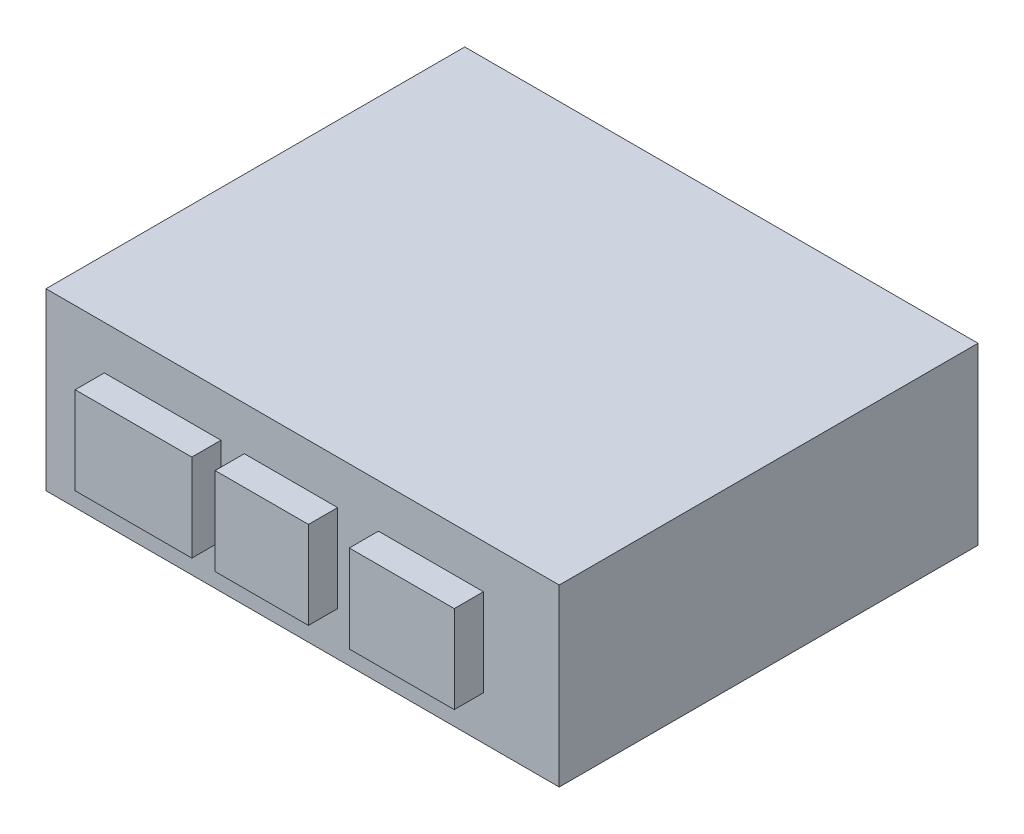
ISO-10303-21;
HEADER;
FILE_DESCRIPTION(('STEP AP214'),'2;1');
FILE_NAME('part.step','',(''),(''),'','','');
FILE_SCHEMA(('AUTOMOTIVE_DESIGN { 1 0 10303 214 1 1 1 1 }'));
ENDSEC;
DATA;
#1=APPLICATION_CONTEXT('core data for automotive mechanical design processes');
#2=APPLICATION_PROTOCOL_DEFINITION('international standard','automotive_design',2000,#1);
#3=PRODUCT_CONTEXT('',#1,'mechanical');
#4=PRODUCT('Part','Part','',(#3));
#5=PRODUCT_RELATED_PRODUCT_CATEGORY('part','',(#4));
#6=PRODUCT_DEFINITION_FORMATION('','',#4);
#7=PRODUCT_DEFINITION_CONTEXT('part definition',#1,'design');
#8=PRODUCT_DEFINITION('design','',#6,#7);
#9=PRODUCT_DEFINITION_SHAPE('','',#8);
#10=(LENGTH_UNIT() NAMED_UNIT(*) SI_UNIT(.MILLI.,.METRE.));
#11=(NAMED_UNIT(*) PLANE_ANGLE_UNIT() SI_UNIT($,.RADIAN.));
#12=(NAMED_UNIT(*) SI_UNIT($,.STERADIAN.) SOLID_ANGLE_UNIT());
#13=UNCERTAINTY_MEASURE_WITH_UNIT(LENGTH_MEASURE(1.E-05),#10,'distance_accuracy_value','');
#14=(GEOMETRIC_REPRESENTATION_CONTEXT(3) GLOBAL_UNCERTAINTY_ASSIGNED_CONTEXT((#13)) GLOBAL_UNIT_ASSIGNED_CONTEXT((#10,
#11,#12)) REPRESENTATION_CONTEXT('',''));
#15=CARTESIAN_POINT('',(0.,0.,0.));
#16=DIRECTION('',(0.,0.,1.));
#17=DIRECTION('',(1.,0.,0.));
#18=AXIS2_PLACEMENT_3D('',#15,#16,#17);
#19=CARTESIAN_POINT('',(-44.,30.,35.9));
#20=DIRECTION('',(0.,0.,-1.));
#21=DIRECTION('',(-1.,0.,0.));
#22=AXIS2_PLACEMENT_3D('',#19,#20,#21);
#23=PLANE('',#22);
#24=DIRECTION('',(0.,1.,0.));
#25=VECTOR('',#24,1.);
#26=CARTESIAN_POINT('',(6.,7.5,35.9));
#27=LINE('',#26,#25);
#28=CARTESIAN_POINT('',(6.,7.5,35.9));
#29=VERTEX_POINT('',#28);
#30=CARTESIAN_POINT('',(6.,22.5,35.9));
#31=VERTEX_POINT('',#30);
#32=EDGE_CURVE('E168',#29,#31,#27,.T.);
#33=ORIENTED_EDGE('',*,*,#32,.F.);
#34=DIRECTION('',(1.,0.,0.));
#35=VECTOR('',#34,1.);
#36=CARTESIAN_POINT('',(-10.,7.5,35.9));
#37=LINE('',#36,#35);
#38=CARTESIAN_POINT('',(-10.,7.5,35.9));
#39=VERTEX_POINT('',#38);
#40=EDGE_CURVE('E181',#39,#29,#37,.T.);
#41=ORIENTED_EDGE('',*,*,#40,.F.);
#42=DIRECTION('',(0.,-1.,0.));
#43=VECTOR('',#42,1.);
#44=CARTESIAN_POINT('',(-10.,7.5,35.9));
#45=LINE('',#44,#43);
#46=CARTESIAN_POINT('',(-10.,22.5,35.9));
#47=VERTEX_POINT('',#46);
#48=EDGE_CURVE('E190',#47,#39,#45,.T.);
#49=ORIENTED_EDGE('',*,*,#48,.F.);
#50=DIRECTION('',(-1.,0.,0.));
#51=VECTOR('',#50,1.);
#52=CARTESIAN_POINT('',(-10.,22.5,35.9));
#53=LINE('',#52,#51);
#54=EDGE_CURVE('E171',#31,#47,#53,.T.);
#55=ORIENTED_EDGE('',*,*,#54,.F.);
#56=EDGE_LOOP('',(#33,#41,#49,#55));
#57=FACE_BOUND('',#56,.T.);
#58=DIRECTION('',(1.,0.,0.));
#59=VECTOR('',#58,1.);
#60=CARTESIAN_POINT('',(-44.,0.,35.9));
#61=LINE('',#60,#59);
#62=CARTESIAN_POINT('',(-44.,0.,35.9));
#63=VERTEX_POINT('',#62);
#64=CARTESIAN_POINT('',(44.,0.,35.9));
#65=VERTEX_POINT('',#64);
#66=EDGE_CURVE('E244',#63,#65,#61,.T.);
#67=ORIENTED_EDGE('',*,*,#66,.T.);
#68=DIRECTION('',(0.,-1.,0.));
#69=VECTOR('',#68,1.);
#70=CARTESIAN_POINT('',(44.,30.,35.9));
#71=LINE('',#70,#69);
#72=CARTESIAN_POINT('',(44.,30.,35.9));
#73=VERTEX_POINT('',#72);
#74=EDGE_CURVE('E250',#73,#65,#71,.T.);
#75=ORIENTED_EDGE('',*,*,#74,.F.);
#76=DIRECTION('',(1.,0.,0.));
#77=VECTOR('',#76,1.);
#78=CARTESIAN_POINT('',(-44.,30.,35.9));
#79=LINE('',#78,#77);
#80=CARTESIAN_POINT('',(-44.,30.,35.9));
#81=VERTEX_POINT('',#80);
#82=EDGE_CURVE('E248',#81,#73,#79,.T.);
#83=ORIENTED_EDGE('',*,*,#82,.F.);
#84=DIRECTION('',(0.,-1.,0.));
#85=VECTOR('',#84,1.);
#86=CARTESIAN_POINT('',(-44.,30.,35.9));
#87=LINE('',#86,#85);
#88=EDGE_CURVE('E260',#81,#63,#87,.T.);
#89=ORIENTED_EDGE('',*,*,#88,.T.);
#90=EDGE_LOOP('',(#67,#75,#83,#89));
#91=FACE_BOUND('',#90,.T.);
#92=DIRECTION('',(0.,1.,0.));
#93=VECTOR('',#92,1.);
#94=CARTESIAN_POINT('',(-14.,7.5,35.9));
#95=LINE('',#94,#93);
#96=CARTESIAN_POINT('',(-14.,7.5,35.9));
#97=VERTEX_POINT('',#96);
#98=CARTESIAN_POINT('',(-14.,22.5,35.9));
#99=VERTEX_POINT('',#98);
#100=EDGE_CURVE('E206',#97,#99,#95,.T.);
#101=ORIENTED_EDGE('',*,*,#100,.F.);
#102=DIRECTION('',(1.,0.,0.));
#103=VECTOR('',#102,1.);
#104=CARTESIAN_POINT('',(-34.,7.5,35.9));
#105=LINE('',#104,#103);
#106=CARTESIAN_POINT('',(-34.,7.5,35.9));
#107=VERTEX_POINT('',#106);
#108=EDGE_CURVE('E211',#107,#97,#105,.T.);
#109=ORIENTED_EDGE('',*,*,#108,.F.);
#110=DIRECTION('',(0.,-1.,0.));
#111=VECTOR('',#110,1.);
#112=CARTESIAN_POINT('',(-34.,7.5,35.9));
#113=LINE('',#112,#111);
#114=CARTESIAN_POINT('',(-34.,22.5,35.9));
#115=VERTEX_POINT('',#114);
#116=EDGE_CURVE('E223',#115,#107,#113,.T.);
#117=ORIENTED_EDGE('',*,*,#116,.F.);
#118=DIRECTION('',(-1.,0.,0.));
#119=VECTOR('',#118,1.);
#120=CARTESIAN_POINT('',(-34.,22.5,35.9));
#121=LINE('',#120,#119);
#122=EDGE_CURVE('E220',#99,#115,#121,.T.);
#123=ORIENTED_EDGE('',*,*,#122,.F.);
#124=EDGE_LOOP('',(#101,#109,#117,#123));
#125=FACE_BOUND('',#124,.T.);
#126=DIRECTION('',(0.,1.,0.));
#127=VECTOR('',#126,1.);
#128=CARTESIAN_POINT('',(31.,7.49999999999999,35.9));
#129=LINE('',#128,#127);
#130=CARTESIAN_POINT('',(31.,7.49999999999999,35.9));
#131=VERTEX_POINT('',#130);
#132=CARTESIAN_POINT('',(31.,22.5,35.9));
#133=VERTEX_POINT('',#132);
#134=EDGE_CURVE('E167',#131,#133,#129,.T.);
#135=ORIENTED_EDGE('',*,*,#134,.F.);
#136=DIRECTION('',(1.,0.,0.));
#137=VECTOR('',#136,1.);
#138=CARTESIAN_POINT('',(13.,7.49999999999999,35.9));
#139=LINE('',#138,#137);
#140=CARTESIAN_POINT('',(13.,7.49999999999999,35.9));
#141=VERTEX_POINT('',#140);
#142=EDGE_CURVE('E164',#141,#131,#139,.T.);
#143=ORIENTED_EDGE('',*,*,#142,.F.);
#144=DIRECTION('',(0.,-1.,0.));
#145=VECTOR('',#144,1.);
#146=CARTESIAN_POINT('',(13.,7.49999999999999,35.9));
#147=LINE('',#146,#145);
#148=CARTESIAN_POINT('',(13.,22.5,35.9));
#149=VERTEX_POINT('',#148);
#150=EDGE_CURVE('E54',#149,#141,#147,.T.);
#151=ORIENTED_EDGE('',*,*,#150,.F.);
#152=DIRECTION('',(-1.,0.,0.));
#153=VECTOR('',#152,1.);
#154=CARTESIAN_POINT('',(13.,22.5,35.9));
#155=LINE('',#154,#153);
#156=EDGE_CURVE('E49',#133,#149,#155,.T.);
#157=ORIENTED_EDGE('',*,*,#156,.F.);
#158=EDGE_LOOP('',(#135,#143,#151,#157));
#159=FACE_BOUND('',#158,.T.);
#160=ADVANCED_FACE('F34',(#57,#91,#125,#159),#23,.F.);
#161=CARTESIAN_POINT('',(44.,30.,35.9));
#162=DIRECTION('',(-1.,0.,0.));
#163=DIRECTION('',(0.,0.,1.));
#164=AXIS2_PLACEMENT_3D('',#161,#162,#163);
#165=PLANE('',#164);
#166=DIRECTION('',(0.,0.,-1.));
#167=VECTOR('',#166,1.);
#168=CARTESIAN_POINT('',(44.,0.,35.9));
#169=LINE('',#168,#167);
#170=CARTESIAN_POINT('',(44.,0.,-35.9));
#171=VERTEX_POINT('',#170);
#172=EDGE_CURVE('E239',#65,#171,#169,.T.);
#173=ORIENTED_EDGE('',*,*,#172,.T.);
#174=DIRECTION('',(0.,-1.,0.));
#175=VECTOR('',#174,1.);
#176=CARTESIAN_POINT('',(44.,30.,-35.9));
#177=LINE('',#176,#175);
#178=CARTESIAN_POINT('',(44.,30.,-35.9));
#179=VERTEX_POINT('',#178);
#180=EDGE_CURVE('E11',#179,#171,#177,.T.);
#181=ORIENTED_EDGE('',*,*,#180,.F.);
#182=DIRECTION('',(0.,0.,-1.));
#183=VECTOR('',#182,1.);
#184=CARTESIAN_POINT('',(44.,30.,35.9));
#185=LINE('',#184,#183);
#186=EDGE_CURVE('E240',#73,#179,#185,.T.);
#187=ORIENTED_EDGE('',*,*,#186,.F.);
#188=ORIENTED_EDGE('',*,*,#74,.T.);
#189=EDGE_LOOP('',(#173,#181,#187,#188));
#190=FACE_BOUND('',#189,.T.);
#191=ADVANCED_FACE('F36',(#190),#165,.F.);
#192=CARTESIAN_POINT('',(-44.,30.,-35.9));
#193=DIRECTION('',(0.,0.,1.));
#194=DIRECTION('',(1.,0.,0.));
#195=AXIS2_PLACEMENT_3D('',#192,#193,#194);
#196=PLANE('',#195);
#197=DIRECTION('',(-1.,0.,0.));
#198=VECTOR('',#197,1.);
#199=CARTESIAN_POINT('',(-44.,0.,-35.9));
#200=LINE('',#199,#198);
#201=CARTESIAN_POINT('',(-44.,0.,-35.9));
#202=VERTEX_POINT('',#201);
#203=EDGE_CURVE('E253',#171,#202,#200,.T.);
#204=ORIENTED_EDGE('',*,*,#203,.T.);
#205=DIRECTION('',(0.,-1.,0.));
#206=VECTOR('',#205,1.);
#207=CARTESIAN_POINT('',(-44.,30.,-35.9));
#208=LINE('',#207,#206);
#209=CARTESIAN_POINT('',(-44.,30.,-35.9));
#210=VERTEX_POINT('',#209);
#211=EDGE_CURVE('E42',#210,#202,#208,.T.);
#212=ORIENTED_EDGE('',*,*,#211,.F.);
#213=DIRECTION('',(-1.,0.,0.));
#214=VECTOR('',#213,1.);
#215=CARTESIAN_POINT('',(-44.,30.,-35.9));
#216=LINE('',#215,#214);
#217=EDGE_CURVE('E243',#179,#210,#216,.T.);
#218=ORIENTED_EDGE('',*,*,#217,.F.);
#219=ORIENTED_EDGE('',*,*,#180,.T.);
#220=EDGE_LOOP('',(#204,#212,#218,#219));
#221=FACE_BOUND('',#220,.T.);
#222=ADVANCED_FACE('F283',(#221),#196,.F.);
#223=CARTESIAN_POINT('',(-44.,30.,35.9));
#224=DIRECTION('',(1.,0.,0.));
#225=DIRECTION('',(0.,0.,-1.));
#226=AXIS2_PLACEMENT_3D('',#223,#224,#225);
#227=PLANE('',#226);
#228=DIRECTION('',(0.,0.,1.));
#229=VECTOR('',#228,1.);
#230=CARTESIAN_POINT('',(-44.,0.,35.9));
#231=LINE('',#230,#229);
#232=EDGE_CURVE('E255',#202,#63,#231,.T.);
#233=ORIENTED_EDGE('',*,*,#232,.T.);
#234=ORIENTED_EDGE('',*,*,#88,.F.);
#235=DIRECTION('',(0.,0.,1.));
#236=VECTOR('',#235,1.);
#237=CARTESIAN_POINT('',(-44.,30.,35.9));
#238=LINE('',#237,#236);
#239=EDGE_CURVE('E246',#210,#81,#238,.T.);
#240=ORIENTED_EDGE('',*,*,#239,.F.);
#241=ORIENTED_EDGE('',*,*,#211,.T.);
#242=EDGE_LOOP('',(#233,#234,#240,#241));
#243=FACE_BOUND('',#242,.T.);
#244=ADVANCED_FACE('F267',(#243),#227,.F.);
#245=CARTESIAN_POINT('',(0.,30.,0.));
#246=DIRECTION('',(0.,-1.,0.));
#247=DIRECTION('',(0.,0.,-1.));
#248=AXIS2_PLACEMENT_3D('',#245,#246,#247);
#249=PLANE('',#248);
#250=ORIENTED_EDGE('',*,*,#186,.T.);
#251=ORIENTED_EDGE('',*,*,#217,.T.);
#252=ORIENTED_EDGE('',*,*,#239,.T.);
#253=ORIENTED_EDGE('',*,*,#82,.T.);
#254=EDGE_LOOP('',(#250,#251,#252,#253));
#255=FACE_BOUND('',#254,.T.);
#256=ADVANCED_FACE('F282',(#255),#249,.F.);
#257=CARTESIAN_POINT('',(0.,0.,0.));
#258=DIRECTION('',(0.,-1.,0.));
#259=DIRECTION('',(0.,0.,-1.));
#260=AXIS2_PLACEMENT_3D('',#257,#258,#259);
#261=PLANE('',#260);
#262=ORIENTED_EDGE('',*,*,#172,.F.);
#263=ORIENTED_EDGE('',*,*,#66,.F.);
#264=ORIENTED_EDGE('',*,*,#232,.F.);
#265=ORIENTED_EDGE('',*,*,#203,.F.);
#266=EDGE_LOOP('',(#262,#263,#264,#265));
#267=FACE_BOUND('',#266,.T.);
#268=ADVANCED_FACE('F273',(#267),#261,.T.);
#269=CARTESIAN_POINT('',(-14.,7.5,40.9));
#270=DIRECTION('',(-1.,0.,0.));
#271=DIRECTION('',(0.,0.,1.));
#272=AXIS2_PLACEMENT_3D('',#269,#270,#271);
#273=PLANE('',#272);
#274=ORIENTED_EDGE('',*,*,#100,.T.);
#275=DIRECTION('',(0.,0.,-1.));
#276=VECTOR('',#275,1.);
#277=CARTESIAN_POINT('',(-14.,22.5,40.9));
#278=LINE('',#277,#276);
#279=CARTESIAN_POINT('',(-14.,22.5,40.9));
#280=VERTEX_POINT('',#279);
#281=EDGE_CURVE('E236',#280,#99,#278,.T.);
#282=ORIENTED_EDGE('',*,*,#281,.F.);
#283=DIRECTION('',(0.,1.,0.));
#284=VECTOR('',#283,1.);
#285=CARTESIAN_POINT('',(-14.,7.5,40.9));
#286=LINE('',#285,#284);
#287=CARTESIAN_POINT('',(-14.,7.5,40.9));
#288=VERTEX_POINT('',#287);
#289=EDGE_CURVE('E207',#288,#280,#286,.T.);
#290=ORIENTED_EDGE('',*,*,#289,.F.);
#291=DIRECTION('',(0.,0.,-1.));
#292=VECTOR('',#291,1.);
#293=CARTESIAN_POINT('',(-14.,7.5,40.9));
#294=LINE('',#293,#292);
#295=EDGE_CURVE('E217',#288,#97,#294,.T.);
#296=ORIENTED_EDGE('',*,*,#295,.T.);
#297=EDGE_LOOP('',(#274,#282,#290,#296));
#298=FACE_BOUND('',#297,.T.);
#299=ADVANCED_FACE('F298',(#298),#273,.F.);
#300=CARTESIAN_POINT('',(-34.,22.5,40.9));
#301=DIRECTION('',(0.,-1.,0.));
#302=DIRECTION('',(0.,0.,-1.));
#303=AXIS2_PLACEMENT_3D('',#300,#301,#302);
#304=PLANE('',#303);
#305=ORIENTED_EDGE('',*,*,#122,.T.);
#306=DIRECTION('',(0.,0.,-1.));
#307=VECTOR('',#306,1.);
#308=CARTESIAN_POINT('',(-34.,22.5,40.9));
#309=LINE('',#308,#307);
#310=CARTESIAN_POINT('',(-34.,22.5,40.9));
#311=VERTEX_POINT('',#310);
#312=EDGE_CURVE('E233',#311,#115,#309,.T.);
#313=ORIENTED_EDGE('',*,*,#312,.F.);
#314=DIRECTION('',(-1.,0.,0.));
#315=VECTOR('',#314,1.);
#316=CARTESIAN_POINT('',(-34.,22.5,40.9));
#317=LINE('',#316,#315);
#318=EDGE_CURVE('E210',#280,#311,#317,.T.);
#319=ORIENTED_EDGE('',*,*,#318,.F.);
#320=ORIENTED_EDGE('',*,*,#281,.T.);
#321=EDGE_LOOP('',(#305,#313,#319,#320));
#322=FACE_BOUND('',#321,.T.);
#323=ADVANCED_FACE('F303',(#322),#304,.F.);
#324=CARTESIAN_POINT('',(-34.,7.5,40.9));
#325=DIRECTION('',(1.,0.,0.));
#326=DIRECTION('',(0.,0.,-1.));
#327=AXIS2_PLACEMENT_3D('',#324,#325,#326);
#328=PLANE('',#327);
#329=ORIENTED_EDGE('',*,*,#116,.T.);
#330=DIRECTION('',(0.,0.,-1.));
#331=VECTOR('',#330,1.);
#332=CARTESIAN_POINT('',(-34.,7.5,40.9));
#333=LINE('',#332,#331);
#334=CARTESIAN_POINT('',(-34.,7.5,40.9));
#335=VERTEX_POINT('',#334);
#336=EDGE_CURVE('E230',#335,#107,#333,.T.);
#337=ORIENTED_EDGE('',*,*,#336,.F.);
#338=DIRECTION('',(0.,-1.,0.));
#339=VECTOR('',#338,1.);
#340=CARTESIAN_POINT('',(-34.,7.5,40.9));
#341=LINE('',#340,#339);
#342=EDGE_CURVE('E213',#311,#335,#341,.T.);
#343=ORIENTED_EDGE('',*,*,#342,.F.);
#344=ORIENTED_EDGE('',*,*,#312,.T.);
#345=EDGE_LOOP('',(#329,#337,#343,#344));
#346=FACE_BOUND('',#345,.T.);
#347=ADVANCED_FACE('F307',(#346),#328,.F.);
#348=CARTESIAN_POINT('',(-34.,7.5,40.9));
#349=DIRECTION('',(0.,1.,0.));
#350=DIRECTION('',(0.,0.,1.));
#351=AXIS2_PLACEMENT_3D('',#348,#349,#350);
#352=PLANE('',#351);
#353=ORIENTED_EDGE('',*,*,#108,.T.);
#354=ORIENTED_EDGE('',*,*,#295,.F.);
#355=DIRECTION('',(1.,0.,0.));
#356=VECTOR('',#355,1.);
#357=CARTESIAN_POINT('',(-34.,7.5,40.9));
#358=LINE('',#357,#356);
#359=EDGE_CURVE('E215',#335,#288,#358,.T.);
#360=ORIENTED_EDGE('',*,*,#359,.F.);
#361=ORIENTED_EDGE('',*,*,#336,.T.);
#362=EDGE_LOOP('',(#353,#354,#360,#361));
#363=FACE_BOUND('',#362,.T.);
#364=ADVANCED_FACE('F311',(#363),#352,.F.);
#365=CARTESIAN_POINT('',(0.,0.,40.9));
#366=DIRECTION('',(0.,0.,-1.));
#367=DIRECTION('',(-1.,0.,0.));
#368=AXIS2_PLACEMENT_3D('',#365,#366,#367);
#369=PLANE('',#368);
#370=ORIENTED_EDGE('',*,*,#289,.T.);
#371=ORIENTED_EDGE('',*,*,#318,.T.);
#372=ORIENTED_EDGE('',*,*,#342,.T.);
#373=ORIENTED_EDGE('',*,*,#359,.T.);
#374=EDGE_LOOP('',(#370,#371,#372,#373));
#375=FACE_BOUND('',#374,.T.);
#376=ADVANCED_FACE('F315',(#375),#369,.F.);
#377=CARTESIAN_POINT('',(6.,7.5,40.9));
#378=DIRECTION('',(-1.,0.,0.));
#379=DIRECTION('',(0.,-1.,0.));
#380=AXIS2_PLACEMENT_3D('',#377,#378,#379);
#381=PLANE('',#380);
#382=ORIENTED_EDGE('',*,*,#32,.T.);
#383=DIRECTION('',(0.,0.,-1.));
#384=VECTOR('',#383,1.);
#385=CARTESIAN_POINT('',(6.,22.5,40.9));
#386=LINE('',#385,#384);
#387=CARTESIAN_POINT('',(6.,22.5,40.9));
#388=VERTEX_POINT('',#387);
#389=EDGE_CURVE('E203',#388,#31,#386,.T.);
#390=ORIENTED_EDGE('',*,*,#389,.F.);
#391=DIRECTION('',(0.,1.,0.));
#392=VECTOR('',#391,1.);
#393=CARTESIAN_POINT('',(6.,7.5,40.9));
#394=LINE('',#393,#392);
#395=CARTESIAN_POINT('',(6.,7.5,40.9));
#396=VERTEX_POINT('',#395);
#397=EDGE_CURVE('E177',#396,#388,#394,.T.);
#398=ORIENTED_EDGE('',*,*,#397,.F.);
#399=DIRECTION('',(0.,0.,-1.));
#400=VECTOR('',#399,1.);
#401=CARTESIAN_POINT('',(6.,7.5,40.9));
#402=LINE('',#401,#400);
#403=EDGE_CURVE('E186',#396,#29,#402,.T.);
#404=ORIENTED_EDGE('',*,*,#403,.T.);
#405=EDGE_LOOP('',(#382,#390,#398,#404));
#406=FACE_BOUND('',#405,.T.);
#407=ADVANCED_FACE('F319',(#406),#381,.F.);
#408=CARTESIAN_POINT('',(-10.,22.5,40.9));
#409=DIRECTION('',(0.,-1.,0.));
#410=DIRECTION('',(0.,0.,-1.));
#411=AXIS2_PLACEMENT_3D('',#408,#409,#410);
#412=PLANE('',#411);
#413=ORIENTED_EDGE('',*,*,#54,.T.);
#414=DIRECTION('',(0.,0.,-1.));
#415=VECTOR('',#414,1.);
#416=CARTESIAN_POINT('',(-10.,22.5,40.9));
#417=LINE('',#416,#415);
#418=CARTESIAN_POINT('',(-10.,22.5,40.9));
#419=VERTEX_POINT('',#418);
#420=EDGE_CURVE('E200',#419,#47,#417,.T.);
#421=ORIENTED_EDGE('',*,*,#420,.F.);
#422=DIRECTION('',(-1.,0.,0.));
#423=VECTOR('',#422,1.);
#424=CARTESIAN_POINT('',(-10.,22.5,40.9));
#425=LINE('',#424,#423);
#426=EDGE_CURVE('E180',#388,#419,#425,.T.);
#427=ORIENTED_EDGE('',*,*,#426,.F.);
#428=ORIENTED_EDGE('',*,*,#389,.T.);
#429=EDGE_LOOP('',(#413,#421,#427,#428));
#430=FACE_BOUND('',#429,.T.);
#431=ADVANCED_FACE('F323',(#430),#412,.F.);
#432=CARTESIAN_POINT('',(-10.,7.5,40.9));
#433=DIRECTION('',(1.,0.,0.));
#434=DIRECTION('',(0.,0.,-1.));
#435=AXIS2_PLACEMENT_3D('',#432,#433,#434);
#436=PLANE('',#435);
#437=ORIENTED_EDGE('',*,*,#48,.T.);
#438=DIRECTION('',(0.,0.,-1.));
#439=VECTOR('',#438,1.);
#440=CARTESIAN_POINT('',(-10.,7.5,40.9));
#441=LINE('',#440,#439);
#442=CARTESIAN_POINT('',(-10.,7.5,40.9));
#443=VERTEX_POINT('',#442);
#444=EDGE_CURVE('E197',#443,#39,#441,.T.);
#445=ORIENTED_EDGE('',*,*,#444,.F.);
#446=DIRECTION('',(0.,-1.,0.));
#447=VECTOR('',#446,1.);
#448=CARTESIAN_POINT('',(-10.,7.5,40.9));
#449=LINE('',#448,#447);
#450=EDGE_CURVE('E183',#419,#443,#449,.T.);
#451=ORIENTED_EDGE('',*,*,#450,.F.);
#452=ORIENTED_EDGE('',*,*,#420,.T.);
#453=EDGE_LOOP('',(#437,#445,#451,#452));
#454=FACE_BOUND('',#453,.T.);
#455=ADVANCED_FACE('F327',(#454),#436,.F.);
#456=CARTESIAN_POINT('',(-10.,7.5,40.9));
#457=DIRECTION('',(0.,1.,0.));
#458=DIRECTION('',(0.,0.,1.));
#459=AXIS2_PLACEMENT_3D('',#456,#457,#458);
#460=PLANE('',#459);
#461=ORIENTED_EDGE('',*,*,#40,.T.);
#462=ORIENTED_EDGE('',*,*,#403,.F.);
#463=DIRECTION('',(1.,0.,0.));
#464=VECTOR('',#463,1.);
#465=CARTESIAN_POINT('',(-10.,7.5,40.9));
#466=LINE('',#465,#464);
#467=EDGE_CURVE('E185',#443,#396,#466,.T.);
#468=ORIENTED_EDGE('',*,*,#467,.F.);
#469=ORIENTED_EDGE('',*,*,#444,.T.);
#470=EDGE_LOOP('',(#461,#462,#468,#469));
#471=FACE_BOUND('',#470,.T.);
#472=ADVANCED_FACE('F331',(#471),#460,.F.);
#473=CARTESIAN_POINT('',(0.,0.,40.9));
#474=DIRECTION('',(0.,0.,-1.));
#475=DIRECTION('',(-1.,0.,0.));
#476=AXIS2_PLACEMENT_3D('',#473,#474,#475);
#477=PLANE('',#476);
#478=ORIENTED_EDGE('',*,*,#397,.T.);
#479=ORIENTED_EDGE('',*,*,#426,.T.);
#480=ORIENTED_EDGE('',*,*,#450,.T.);
#481=ORIENTED_EDGE('',*,*,#467,.T.);
#482=EDGE_LOOP('',(#478,#479,#480,#481));
#483=FACE_BOUND('',#482,.T.);
#484=ADVANCED_FACE('F335',(#483),#477,.F.);
#485=CARTESIAN_POINT('',(31.,7.49999999999999,40.9));
#486=DIRECTION('',(-1.,0.,0.));
#487=DIRECTION('',(0.,0.,1.));
#488=AXIS2_PLACEMENT_3D('',#485,#486,#487);
#489=PLANE('',#488);
#490=ORIENTED_EDGE('',*,*,#134,.T.);
#491=DIRECTION('',(0.,0.,-1.));
#492=VECTOR('',#491,1.);
#493=CARTESIAN_POINT('',(31.,22.5,40.9));
#494=LINE('',#493,#492);
#495=CARTESIAN_POINT('',(31.,22.5,40.9));
#496=VERTEX_POINT('',#495);
#497=EDGE_CURVE('E148',#496,#133,#494,.T.);
#498=ORIENTED_EDGE('',*,*,#497,.F.);
#499=DIRECTION('',(0.,1.,0.));
#500=VECTOR('',#499,1.);
#501=CARTESIAN_POINT('',(31.,7.49999999999999,40.9));
#502=LINE('',#501,#500);
#503=CARTESIAN_POINT('',(31.,7.49999999999999,40.9));
#504=VERTEX_POINT('',#503);
#505=EDGE_CURVE('E155',#504,#496,#502,.T.);
#506=ORIENTED_EDGE('',*,*,#505,.F.);
#507=DIRECTION('',(0.,0.,-1.));
#508=VECTOR('',#507,1.);
#509=CARTESIAN_POINT('',(31.,7.49999999999999,40.9));
#510=LINE('',#509,#508);
#511=EDGE_CURVE('E477',#504,#131,#510,.T.);
#512=ORIENTED_EDGE('',*,*,#511,.T.);
#513=EDGE_LOOP('',(#490,#498,#506,#512));
#514=FACE_BOUND('',#513,.T.);
#515=ADVANCED_FACE('F166',(#514),#489,.F.);
#516=CARTESIAN_POINT('',(13.,22.5,40.9));
#517=DIRECTION('',(0.,-1.,0.));
#518=DIRECTION('',(0.,0.,-1.));
#519=AXIS2_PLACEMENT_3D('',#516,#517,#518);
#520=PLANE('',#519);
#521=ORIENTED_EDGE('',*,*,#156,.T.);
#522=DIRECTION('',(0.,0.,-1.));
#523=VECTOR('',#522,1.);
#524=CARTESIAN_POINT('',(13.,22.5,40.9));
#525=LINE('',#524,#523);
#526=CARTESIAN_POINT('',(13.,22.5,40.9));
#527=VERTEX_POINT('',#526);
#528=EDGE_CURVE('E151',#527,#149,#525,.T.);
#529=ORIENTED_EDGE('',*,*,#528,.F.);
#530=DIRECTION('',(-1.,0.,0.));
#531=VECTOR('',#530,1.);
#532=CARTESIAN_POINT('',(13.,22.5,40.9));
#533=LINE('',#532,#531);
#534=EDGE_CURVE('E144',#496,#527,#533,.T.);
#535=ORIENTED_EDGE('',*,*,#534,.F.);
#536=ORIENTED_EDGE('',*,*,#497,.T.);
#537=EDGE_LOOP('',(#521,#529,#535,#536));
#538=FACE_BOUND('',#537,.T.);
#539=ADVANCED_FACE('F146',(#538),#520,.F.);
#540=CARTESIAN_POINT('',(13.,7.49999999999999,40.9));
#541=DIRECTION('',(1.,0.,0.));
#542=DIRECTION('',(0.,0.,-1.));
#543=AXIS2_PLACEMENT_3D('',#540,#541,#542);
#544=PLANE('',#543);
#545=ORIENTED_EDGE('',*,*,#150,.T.);
#546=DIRECTION('',(0.,0.,-1.));
#547=VECTOR('',#546,1.);
#548=CARTESIAN_POINT('',(13.,7.49999999999999,40.9));
#549=LINE('',#548,#547);
#550=CARTESIAN_POINT('',(13.,7.49999999999999,40.9));
#551=VERTEX_POINT('',#550);
#552=EDGE_CURVE('E173',#551,#141,#549,.T.);
#553=ORIENTED_EDGE('',*,*,#552,.F.);
#554=DIRECTION('',(0.,-1.,0.));
#555=VECTOR('',#554,1.);
#556=CARTESIAN_POINT('',(13.,7.49999999999999,40.9));
#557=LINE('',#556,#555);
#558=EDGE_CURVE('E154',#527,#551,#557,.T.);
#559=ORIENTED_EDGE('',*,*,#558,.F.);
#560=ORIENTED_EDGE('',*,*,#528,.T.);
#561=EDGE_LOOP('',(#545,#553,#559,#560));
#562=FACE_BOUND('',#561,.T.);
#563=ADVANCED_FACE('F344',(#562),#544,.F.);
#564=CARTESIAN_POINT('',(13.,7.49999999999999,40.9));
#565=DIRECTION('',(0.,1.,0.));
#566=DIRECTION('',(0.,0.,1.));
#567=AXIS2_PLACEMENT_3D('',#564,#565,#566);
#568=PLANE('',#567);
#569=ORIENTED_EDGE('',*,*,#142,.T.);
#570=ORIENTED_EDGE('',*,*,#511,.F.);
#571=DIRECTION('',(1.,0.,0.));
#572=VECTOR('',#571,1.);
#573=CARTESIAN_POINT('',(13.,7.49999999999999,40.9));
#574=LINE('',#573,#572);
#575=EDGE_CURVE('E160',#551,#504,#574,.T.);
#576=ORIENTED_EDGE('',*,*,#575,.F.);
#577=ORIENTED_EDGE('',*,*,#552,.T.);
#578=EDGE_LOOP('',(#569,#570,#576,#577));
#579=FACE_BOUND('',#578,.T.);
#580=ADVANCED_FACE('F347',(#579),#568,.F.);
#581=CARTESIAN_POINT('',(0.,0.,40.9));
#582=DIRECTION('',(0.,0.,-1.));
#583=DIRECTION('',(-1.,0.,0.));
#584=AXIS2_PLACEMENT_3D('',#581,#582,#583);
#585=PLANE('',#584);
#586=ORIENTED_EDGE('',*,*,#505,.T.);
#587=ORIENTED_EDGE('',*,*,#534,.T.);
#588=ORIENTED_EDGE('',*,*,#558,.T.);
#589=ORIENTED_EDGE('',*,*,#575,.T.);
#590=EDGE_LOOP('',(#586,#587,#588,#589));
#591=FACE_BOUND('',#590,.T.);
#592=ADVANCED_FACE('F158',(#591),#585,.F.);
#593=CLOSED_SHELL('',(#160,#191,#222,#244,#256,#268,#299,#323,#347,#364,#376,#407,#431,#455,
#472,#484,#515,#539,#563,#580,#592));
#594=MANIFOLD_SOLID_BREP('B2',#593);
#595=ADVANCED_BREP_SHAPE_REPRESENTATION('',(#18,#594),#14);
#596=SHAPE_DEFINITION_REPRESENTATION(#9,#595);
ENDSEC;
END-ISO-10303-21;
